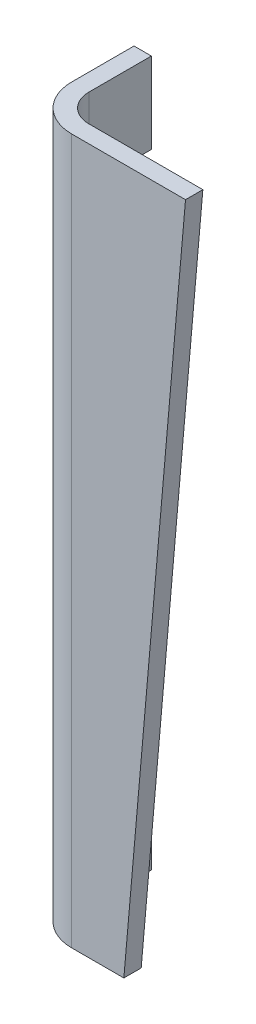
ISO-10303-21;
HEADER;
FILE_DESCRIPTION(('STEP AP214'),'2;1');
FILE_NAME('part.step','',(''),(''),'','','');
FILE_SCHEMA(('AUTOMOTIVE_DESIGN { 1 0 10303 214 1 1 1 1 }'));
ENDSEC;
DATA;
#1=APPLICATION_CONTEXT('core data for automotive mechanical design processes');
#2=APPLICATION_PROTOCOL_DEFINITION('international standard','automotive_design',2000,#1);
#3=PRODUCT_CONTEXT('',#1,'mechanical');
#4=PRODUCT('Part','Part','',(#3));
#5=PRODUCT_RELATED_PRODUCT_CATEGORY('part','',(#4));
#6=PRODUCT_DEFINITION_FORMATION('','',#4);
#7=PRODUCT_DEFINITION_CONTEXT('part definition',#1,'design');
#8=PRODUCT_DEFINITION('design','',#6,#7);
#9=PRODUCT_DEFINITION_SHAPE('','',#8);
#10=(LENGTH_UNIT() NAMED_UNIT(*) SI_UNIT(.MILLI.,.METRE.));
#11=(NAMED_UNIT(*) PLANE_ANGLE_UNIT() SI_UNIT($,.RADIAN.));
#12=(NAMED_UNIT(*) SI_UNIT($,.STERADIAN.) SOLID_ANGLE_UNIT());
#13=UNCERTAINTY_MEASURE_WITH_UNIT(LENGTH_MEASURE(1.E-05),#10,'distance_accuracy_value','');
#14=(GEOMETRIC_REPRESENTATION_CONTEXT(3) GLOBAL_UNCERTAINTY_ASSIGNED_CONTEXT((#13)) GLOBAL_UNIT_ASSIGNED_CONTEXT((#10,
#11,#12)) REPRESENTATION_CONTEXT('',''));
#15=CARTESIAN_POINT('',(0.,0.,0.));
#16=DIRECTION('',(0.,0.,1.));
#17=DIRECTION('',(1.,0.,0.));
#18=AXIS2_PLACEMENT_3D('',#15,#16,#17);
#19=CARTESIAN_POINT('',(40.07981211837,63.84236,-113.94034));
#20=DIRECTION('',(-1.,0.,0.));
#21=DIRECTION('',(0.,0.,1.));
#22=AXIS2_PLACEMENT_3D('',#19,#20,#21);
#23=CYLINDRICAL_SURFACE('',#22,2.381);
#24=CARTESIAN_POINT('',(32.73633124671,63.84236,-113.94034));
#25=DIRECTION('',(-1.,0.,0.));
#26=DIRECTION('',(0.,0.,1.));
#27=AXIS2_PLACEMENT_3D('',#24,#25,#26);
#28=CIRCLE('',#27,2.381);
#29=CARTESIAN_POINT('',(32.73633124671,66.22336,-113.94034));
#30=VERTEX_POINT('',#29);
#31=CARTESIAN_POINT('',(32.73633124671,63.84236,-111.55934));
#32=VERTEX_POINT('',#31);
#33=EDGE_CURVE('E167',#30,#32,#28,.F.);
#34=ORIENTED_EDGE('',*,*,#33,.T.);
#35=DIRECTION('',(1.,0.,0.));
#36=VECTOR('',#35,1.);
#37=CARTESIAN_POINT('',(72.09491389266,63.84236,-111.55934));
#38=LINE('',#37,#36);
#39=CARTESIAN_POINT('',(29.73633124671,63.84236,-111.55934));
#40=VERTEX_POINT('',#39);
#41=EDGE_CURVE('E166',#32,#40,#38,.F.);
#42=ORIENTED_EDGE('',*,*,#41,.T.);
#43=CARTESIAN_POINT('',(29.73633124671,63.84236,-113.94034));
#44=DIRECTION('',(-1.,0.,0.));
#45=DIRECTION('',(0.,0.,1.));
#46=AXIS2_PLACEMENT_3D('',#43,#44,#45);
#47=CIRCLE('',#46,2.381);
#48=CARTESIAN_POINT('',(29.73633124671,66.22336,-113.94034));
#49=VERTEX_POINT('',#48);
#50=EDGE_CURVE('E20',#49,#40,#47,.F.);
#51=ORIENTED_EDGE('',*,*,#50,.F.);
#52=DIRECTION('',(1.,0.,0.));
#53=VECTOR('',#52,1.);
#54=CARTESIAN_POINT('',(40.07981211837,66.22336,-113.94034));
#55=LINE('',#54,#53);
#56=EDGE_CURVE('E151',#49,#30,#55,.T.);
#57=ORIENTED_EDGE('',*,*,#56,.T.);
#58=EDGE_LOOP('',(#34,#42,#51,#57));
#59=FACE_BOUND('',#58,.T.);
#60=ADVANCED_FACE('F17',(#59),#23,.F.);
#61=CARTESIAN_POINT('',(72.09491389266,65.14211,-111.55934));
#62=DIRECTION('',(0.,0.,1.));
#63=DIRECTION('',(1.,0.,0.));
#64=AXIS2_PLACEMENT_3D('',#61,#62,#63);
#65=PLANE('',#64);
#66=DIRECTION('',(0.,1.,0.));
#67=VECTOR('',#66,1.);
#68=CARTESIAN_POINT('',(32.73633124671,0.,-111.55934));
#69=LINE('',#68,#67);
#70=CARTESIAN_POINT('',(32.73633124671,6.40461,-111.55934));
#71=VERTEX_POINT('',#70);
#72=EDGE_CURVE('E278',#32,#71,#69,.F.);
#73=ORIENTED_EDGE('',*,*,#72,.T.);
#74=DIRECTION('',(-1.,0.,0.));
#75=VECTOR('',#74,1.);
#76=CARTESIAN_POINT('',(72.09491389266,6.40461,-111.55934));
#77=LINE('',#76,#75);
#78=CARTESIAN_POINT('',(29.73633124671,6.40461,-111.55934));
#79=VERTEX_POINT('',#78);
#80=EDGE_CURVE('E171',#71,#79,#77,.T.);
#81=ORIENTED_EDGE('',*,*,#80,.T.);
#82=DIRECTION('',(0.,1.,0.));
#83=VECTOR('',#82,1.);
#84=CARTESIAN_POINT('',(29.73633124671,0.,-111.55934));
#85=LINE('',#84,#83);
#86=EDGE_CURVE('E160',#40,#79,#85,.F.);
#87=ORIENTED_EDGE('',*,*,#86,.F.);
#88=ORIENTED_EDGE('',*,*,#41,.F.);
#89=EDGE_LOOP('',(#73,#81,#87,#88));
#90=FACE_BOUND('',#89,.T.);
#91=ADVANCED_FACE('F173',(#90),#65,.F.);
#92=CARTESIAN_POINT('',(72.09491389266,6.40461,-113.94059));
#93=DIRECTION('',(-1.,0.,0.));
#94=DIRECTION('',(0.,0.,1.));
#95=AXIS2_PLACEMENT_3D('',#92,#93,#94);
#96=CYLINDRICAL_SURFACE('',#95,2.38125);
#97=CARTESIAN_POINT('',(32.73633124671,6.40461,-113.94059));
#98=DIRECTION('',(-1.,0.,0.));
#99=DIRECTION('',(0.,0.,1.));
#100=AXIS2_PLACEMENT_3D('',#97,#98,#99);
#101=CIRCLE('',#100,2.38125);
#102=CARTESIAN_POINT('',(32.73633124671,4.02336,-113.94059));
#103=VERTEX_POINT('',#102);
#104=EDGE_CURVE('E275',#71,#103,#101,.F.);
#105=ORIENTED_EDGE('',*,*,#104,.T.);
#106=DIRECTION('',(1.,0.,0.));
#107=VECTOR('',#106,1.);
#108=CARTESIAN_POINT('',(72.09491389266,4.02336,-113.94059));
#109=LINE('',#108,#107);
#110=CARTESIAN_POINT('',(29.73633124671,4.02336,-113.94059));
#111=VERTEX_POINT('',#110);
#112=EDGE_CURVE('E241',#103,#111,#109,.F.);
#113=ORIENTED_EDGE('',*,*,#112,.T.);
#114=CARTESIAN_POINT('',(29.73633124671,6.40461,-113.94059));
#115=DIRECTION('',(-1.,0.,0.));
#116=DIRECTION('',(0.,0.,1.));
#117=AXIS2_PLACEMENT_3D('',#114,#115,#116);
#118=CIRCLE('',#117,2.38125);
#119=EDGE_CURVE('E175',#79,#111,#118,.F.);
#120=ORIENTED_EDGE('',*,*,#119,.F.);
#121=ORIENTED_EDGE('',*,*,#80,.F.);
#122=EDGE_LOOP('',(#105,#113,#120,#121));
#123=FACE_BOUND('',#122,.T.);
#124=ADVANCED_FACE('F437',(#123),#96,.F.);
#125=CARTESIAN_POINT('',(72.09491389266,4.02336,-113.94059));
#126=DIRECTION('',(0.,-1.,0.));
#127=DIRECTION('',(0.,0.,-1.));
#128=AXIS2_PLACEMENT_3D('',#125,#126,#127);
#129=PLANE('',#128);
#130=DIRECTION('',(0.,0.,1.));
#131=VECTOR('',#130,1.);
#132=CARTESIAN_POINT('',(32.73633124671,4.02336,-2.75336));
#133=LINE('',#132,#131);
#134=CARTESIAN_POINT('',(32.73633124671,4.02336,-116.32184));
#135=VERTEX_POINT('',#134);
#136=EDGE_CURVE('E237',#103,#135,#133,.F.);
#137=ORIENTED_EDGE('',*,*,#136,.T.);
#138=DIRECTION('',(-1.,0.,0.));
#139=VECTOR('',#138,1.);
#140=CARTESIAN_POINT('',(27.97383124671,4.02336,-116.32184));
#141=LINE('',#140,#139);
#142=CARTESIAN_POINT('',(29.73633124671,4.02336,-116.32184));
#143=VERTEX_POINT('',#142);
#144=EDGE_CURVE('E230',#143,#135,#141,.F.);
#145=ORIENTED_EDGE('',*,*,#144,.F.);
#146=DIRECTION('',(0.,0.,1.));
#147=VECTOR('',#146,1.);
#148=CARTESIAN_POINT('',(29.73633124671,4.02336,-2.75336));
#149=LINE('',#148,#147);
#150=EDGE_CURVE('E177',#111,#143,#149,.F.);
#151=ORIENTED_EDGE('',*,*,#150,.F.);
#152=ORIENTED_EDGE('',*,*,#112,.F.);
#153=EDGE_LOOP('',(#137,#145,#151,#152));
#154=FACE_BOUND('',#153,.T.);
#155=ADVANCED_FACE('F296',(#154),#129,.F.);
#156=CARTESIAN_POINT('',(27.97383124671,80.22336,-116.32184));
#157=DIRECTION('',(0.,0.,-1.));
#158=DIRECTION('',(-1.,0.,0.));
#159=AXIS2_PLACEMENT_3D('',#156,#157,#158);
#160=PLANE('',#159);
#161=DIRECTION('',(0.,1.,0.));
#162=VECTOR('',#161,1.);
#163=CARTESIAN_POINT('',(32.73633124671,0.,-116.32184));
#164=LINE('',#163,#162);
#165=CARTESIAN_POINT('',(32.73633124671,-13.75664,-116.32184));
#166=VERTEX_POINT('',#165);
#167=EDGE_CURVE('E233',#135,#166,#164,.F.);
#168=ORIENTED_EDGE('',*,*,#167,.T.);
#169=DIRECTION('',(1.,0.,0.));
#170=VECTOR('',#169,1.);
#171=CARTESIAN_POINT('',(-25.79021716039,-13.75664,-116.32184));
#172=LINE('',#171,#170);
#173=CARTESIAN_POINT('',(29.73633124671,-13.75664,-116.32184));
#174=VERTEX_POINT('',#173);
#175=EDGE_CURVE('E227',#166,#174,#172,.F.);
#176=ORIENTED_EDGE('',*,*,#175,.T.);
#177=DIRECTION('',(0.,1.,0.));
#178=VECTOR('',#177,1.);
#179=CARTESIAN_POINT('',(29.73633124671,0.,-116.32184));
#180=LINE('',#179,#178);
#181=EDGE_CURVE('E247',#143,#174,#180,.F.);
#182=ORIENTED_EDGE('',*,*,#181,.F.);
#183=ORIENTED_EDGE('',*,*,#144,.T.);
#184=EDGE_LOOP('',(#168,#176,#182,#183));
#185=FACE_BOUND('',#184,.T.);
#186=ADVANCED_FACE('F300',(#185),#160,.T.);
#187=CARTESIAN_POINT('',(-25.79021716039,-13.75664,-116.32184));
#188=DIRECTION('',(0.,1.,0.));
#189=DIRECTION('',(0.,0.,1.));
#190=AXIS2_PLACEMENT_3D('',#187,#188,#189);
#191=PLANE('',#190);
#192=DIRECTION('',(0.,0.,1.));
#193=VECTOR('',#192,1.);
#194=CARTESIAN_POINT('',(32.73633124671,-13.75664,-2.75336));
#195=LINE('',#194,#193);
#196=CARTESIAN_POINT('',(32.73633124671,-13.75664,-113.94059));
#197=VERTEX_POINT('',#196);
#198=EDGE_CURVE('E236',#166,#197,#195,.T.);
#199=ORIENTED_EDGE('',*,*,#198,.T.);
#200=DIRECTION('',(1.,0.,0.));
#201=VECTOR('',#200,1.);
#202=CARTESIAN_POINT('',(-25.79021716039,-13.75664,-113.94059));
#203=LINE('',#202,#201);
#204=CARTESIAN_POINT('',(29.73633124671,-13.75664,-113.94059));
#205=VERTEX_POINT('',#204);
#206=EDGE_CURVE('E224',#197,#205,#203,.F.);
#207=ORIENTED_EDGE('',*,*,#206,.T.);
#208=DIRECTION('',(0.,0.,1.));
#209=VECTOR('',#208,1.);
#210=CARTESIAN_POINT('',(29.73633124671,-13.75664,-2.75336));
#211=LINE('',#210,#209);
#212=EDGE_CURVE('E249',#174,#205,#211,.T.);
#213=ORIENTED_EDGE('',*,*,#212,.F.);
#214=ORIENTED_EDGE('',*,*,#175,.F.);
#215=EDGE_LOOP('',(#199,#207,#213,#214));
#216=FACE_BOUND('',#215,.T.);
#217=ADVANCED_FACE('F304',(#216),#191,.F.);
#218=CARTESIAN_POINT('',(-25.79021716039,-16.13789,-113.94059));
#219=DIRECTION('',(1.,0.,0.));
#220=DIRECTION('',(0.,0.,-1.));
#221=AXIS2_PLACEMENT_3D('',#218,#219,#220);
#222=CYLINDRICAL_SURFACE('',#221,2.38125);
#223=CARTESIAN_POINT('',(32.73633124671,-16.13789,-113.94059));
#224=DIRECTION('',(1.,0.,0.));
#225=DIRECTION('',(0.,0.,-1.));
#226=AXIS2_PLACEMENT_3D('',#223,#224,#225);
#227=CIRCLE('',#226,2.38125);
#228=CARTESIAN_POINT('',(32.73633124671,-16.13789,-111.55934));
#229=VERTEX_POINT('',#228);
#230=EDGE_CURVE('E272',#197,#229,#227,.T.);
#231=ORIENTED_EDGE('',*,*,#230,.T.);
#232=DIRECTION('',(1.,0.,0.));
#233=VECTOR('',#232,1.);
#234=CARTESIAN_POINT('',(-25.79021716039,-16.13789,-111.55934));
#235=LINE('',#234,#233);
#236=CARTESIAN_POINT('',(29.73633124671,-16.13789,-111.55934));
#237=VERTEX_POINT('',#236);
#238=EDGE_CURVE('E221',#229,#237,#235,.F.);
#239=ORIENTED_EDGE('',*,*,#238,.T.);
#240=CARTESIAN_POINT('',(29.73633124671,-16.13789,-113.94059));
#241=DIRECTION('',(1.,0.,0.));
#242=DIRECTION('',(0.,0.,-1.));
#243=AXIS2_PLACEMENT_3D('',#240,#241,#242);
#244=CIRCLE('',#243,2.38125);
#245=EDGE_CURVE('E283',#205,#237,#244,.T.);
#246=ORIENTED_EDGE('',*,*,#245,.F.);
#247=ORIENTED_EDGE('',*,*,#206,.F.);
#248=EDGE_LOOP('',(#231,#239,#246,#247));
#249=FACE_BOUND('',#248,.T.);
#250=ADVANCED_FACE('F307',(#249),#222,.F.);
#251=CARTESIAN_POINT('',(-25.79021716039,-16.13789,-111.55934));
#252=DIRECTION('',(0.,0.,1.));
#253=DIRECTION('',(1.,0.,0.));
#254=AXIS2_PLACEMENT_3D('',#251,#252,#253);
#255=PLANE('',#254);
#256=DIRECTION('',(0.,1.,0.));
#257=VECTOR('',#256,1.);
#258=CARTESIAN_POINT('',(32.73633124671,0.,-111.55934));
#259=LINE('',#258,#257);
#260=CARTESIAN_POINT('',(32.73633124671,-26.29789,-111.55934));
#261=VERTEX_POINT('',#260);
#262=EDGE_CURVE('E271',#229,#261,#259,.F.);
#263=ORIENTED_EDGE('',*,*,#262,.T.);
#264=DIRECTION('',(1.,0.,0.));
#265=VECTOR('',#264,1.);
#266=CARTESIAN_POINT('',(-25.79021716039,-26.29789,-111.55934));
#267=LINE('',#266,#265);
#268=CARTESIAN_POINT('',(29.73633124671,-26.29789,-111.55934));
#269=VERTEX_POINT('',#268);
#270=EDGE_CURVE('E218',#261,#269,#267,.F.);
#271=ORIENTED_EDGE('',*,*,#270,.T.);
#272=DIRECTION('',(0.,1.,0.));
#273=VECTOR('',#272,1.);
#274=CARTESIAN_POINT('',(29.73633124671,0.,-111.55934));
#275=LINE('',#274,#273);
#276=EDGE_CURVE('E282',#237,#269,#275,.F.);
#277=ORIENTED_EDGE('',*,*,#276,.F.);
#278=ORIENTED_EDGE('',*,*,#238,.F.);
#279=EDGE_LOOP('',(#263,#271,#277,#278));
#280=FACE_BOUND('',#279,.T.);
#281=ADVANCED_FACE('F312',(#280),#255,.F.);
#282=CARTESIAN_POINT('',(-25.79021716039,-26.29789,-113.94059));
#283=DIRECTION('',(1.,0.,0.));
#284=DIRECTION('',(0.,0.,-1.));
#285=AXIS2_PLACEMENT_3D('',#282,#283,#284);
#286=CYLINDRICAL_SURFACE('',#285,2.38125);
#287=CARTESIAN_POINT('',(32.73633124671,-26.29789,-113.94059));
#288=DIRECTION('',(1.,0.,0.));
#289=DIRECTION('',(0.,0.,-1.));
#290=AXIS2_PLACEMENT_3D('',#287,#288,#289);
#291=CIRCLE('',#290,2.38125);
#292=CARTESIAN_POINT('',(32.73633124671,-28.67914,-113.94059));
#293=VERTEX_POINT('',#292);
#294=EDGE_CURVE('E267',#261,#293,#291,.T.);
#295=ORIENTED_EDGE('',*,*,#294,.T.);
#296=DIRECTION('',(1.,0.,0.));
#297=VECTOR('',#296,1.);
#298=CARTESIAN_POINT('',(-25.79021716039,-28.67914,-113.94059));
#299=LINE('',#298,#297);
#300=CARTESIAN_POINT('',(29.73633124671,-28.67914,-113.94059));
#301=VERTEX_POINT('',#300);
#302=EDGE_CURVE('E207',#293,#301,#299,.F.);
#303=ORIENTED_EDGE('',*,*,#302,.T.);
#304=CARTESIAN_POINT('',(29.73633124671,-26.29789,-113.94059));
#305=DIRECTION('',(1.,0.,0.));
#306=DIRECTION('',(0.,0.,-1.));
#307=AXIS2_PLACEMENT_3D('',#304,#305,#306);
#308=CIRCLE('',#307,2.38125);
#309=EDGE_CURVE('E280',#269,#301,#308,.T.);
#310=ORIENTED_EDGE('',*,*,#309,.F.);
#311=ORIENTED_EDGE('',*,*,#270,.F.);
#312=EDGE_LOOP('',(#295,#303,#310,#311));
#313=FACE_BOUND('',#312,.T.);
#314=ADVANCED_FACE('F318',(#313),#286,.F.);
#315=CARTESIAN_POINT('',(-25.79021716039,-28.67914,-116.32184));
#316=DIRECTION('',(0.,-1.,0.));
#317=DIRECTION('',(0.,0.,-1.));
#318=AXIS2_PLACEMENT_3D('',#315,#316,#317);
#319=PLANE('',#318);
#320=DIRECTION('',(0.,0.,1.));
#321=VECTOR('',#320,1.);
#322=CARTESIAN_POINT('',(32.73633124671,-28.67914,-2.75336));
#323=LINE('',#322,#321);
#324=CARTESIAN_POINT('',(32.73633124671,-28.67914,-116.32184));
#325=VERTEX_POINT('',#324);
#326=EDGE_CURVE('E270',#293,#325,#323,.F.);
#327=ORIENTED_EDGE('',*,*,#326,.T.);
#328=DIRECTION('',(-1.,0.,0.));
#329=VECTOR('',#328,1.);
#330=CARTESIAN_POINT('',(27.97383124671,-28.67914,-116.32184));
#331=LINE('',#330,#329);
#332=CARTESIAN_POINT('',(29.73633124671,-28.67914,-116.32184));
#333=VERTEX_POINT('',#332);
#334=EDGE_CURVE('E211',#333,#325,#331,.F.);
#335=ORIENTED_EDGE('',*,*,#334,.F.);
#336=DIRECTION('',(0.,0.,1.));
#337=VECTOR('',#336,1.);
#338=CARTESIAN_POINT('',(29.73633124671,-28.67914,-2.75336));
#339=LINE('',#338,#337);
#340=EDGE_CURVE('E185',#301,#333,#339,.F.);
#341=ORIENTED_EDGE('',*,*,#340,.F.);
#342=ORIENTED_EDGE('',*,*,#302,.F.);
#343=EDGE_LOOP('',(#327,#335,#341,#342));
#344=FACE_BOUND('',#343,.T.);
#345=ADVANCED_FACE('F324',(#344),#319,.F.);
#346=CARTESIAN_POINT('',(40.07981211837,66.22336,-116.32184));
#347=DIRECTION('',(0.,1.,0.));
#348=DIRECTION('',(0.,0.,1.));
#349=AXIS2_PLACEMENT_3D('',#346,#347,#348);
#350=PLANE('',#349);
#351=DIRECTION('',(0.,0.,1.));
#352=VECTOR('',#351,1.);
#353=CARTESIAN_POINT('',(32.73633124671,66.22336,-2.75336));
#354=LINE('',#353,#352);
#355=CARTESIAN_POINT('',(32.73633124671,66.22336,-116.32184));
#356=VERTEX_POINT('',#355);
#357=EDGE_CURVE('E189',#356,#30,#354,.T.);
#358=ORIENTED_EDGE('',*,*,#357,.T.);
#359=ORIENTED_EDGE('',*,*,#56,.F.);
#360=DIRECTION('',(0.,0.,1.));
#361=VECTOR('',#360,1.);
#362=CARTESIAN_POINT('',(29.73633124671,66.22336,-2.75336));
#363=LINE('',#362,#361);
#364=CARTESIAN_POINT('',(29.73633124671,66.22336,-116.32184));
#365=VERTEX_POINT('',#364);
#366=EDGE_CURVE('E162',#365,#49,#363,.T.);
#367=ORIENTED_EDGE('',*,*,#366,.F.);
#368=DIRECTION('',(-1.,0.,0.));
#369=VECTOR('',#368,1.);
#370=CARTESIAN_POINT('',(27.97383124671,66.22336,-116.32184));
#371=LINE('',#370,#369);
#372=EDGE_CURVE('E164',#356,#365,#371,.T.);
#373=ORIENTED_EDGE('',*,*,#372,.F.);
#374=EDGE_LOOP('',(#358,#359,#367,#373));
#375=FACE_BOUND('',#374,.T.);
#376=ADVANCED_FACE('F473',(#375),#350,.F.);
#377=CARTESIAN_POINT('',(27.97383124671,80.22336,-116.32184));
#378=DIRECTION('',(0.,0.,-1.));
#379=DIRECTION('',(-1.,0.,0.));
#380=AXIS2_PLACEMENT_3D('',#377,#378,#379);
#381=PLANE('',#380);
#382=DIRECTION('',(0.,1.,0.));
#383=VECTOR('',#382,1.);
#384=CARTESIAN_POINT('',(32.73633124671,0.,-116.32184));
#385=LINE('',#384,#383);
#386=CARTESIAN_POINT('',(32.73633124671,80.22336,-116.32184));
#387=VERTEX_POINT('',#386);
#388=EDGE_CURVE('E190',#387,#356,#385,.F.);
#389=ORIENTED_EDGE('',*,*,#388,.T.);
#390=ORIENTED_EDGE('',*,*,#372,.T.);
#391=DIRECTION('',(0.,1.,0.));
#392=VECTOR('',#391,1.);
#393=CARTESIAN_POINT('',(29.73633124671,0.,-116.32184));
#394=LINE('',#393,#392);
#395=CARTESIAN_POINT('',(29.73633124671,80.22336,-116.32184));
#396=VERTEX_POINT('',#395);
#397=EDGE_CURVE('E184',#396,#365,#394,.F.);
#398=ORIENTED_EDGE('',*,*,#397,.F.);
#399=DIRECTION('',(1.,0.,0.));
#400=VECTOR('',#399,1.);
#401=CARTESIAN_POINT('',(37.51153124671,80.22336,-116.32184));
#402=LINE('',#401,#400);
#403=EDGE_CURVE('E196',#396,#387,#402,.T.);
#404=ORIENTED_EDGE('',*,*,#403,.T.);
#405=EDGE_LOOP('',(#389,#390,#398,#404));
#406=FACE_BOUND('',#405,.T.);
#407=ADVANCED_FACE('F470',(#406),#381,.T.);
#408=CARTESIAN_POINT('',(37.51153124671,80.22336,-105.53192));
#409=DIRECTION('',(0.,1.,0.));
#410=DIRECTION('',(0.,0.,1.));
#411=AXIS2_PLACEMENT_3D('',#408,#409,#410);
#412=CYLINDRICAL_SURFACE('',#411,7.7752);
#413=CARTESIAN_POINT('',(37.51153124671,-41.69664,-105.53192));
#414=DIRECTION('',(0.,1.,0.));
#415=DIRECTION('',(0.,0.,1.));
#416=AXIS2_PLACEMENT_3D('',#413,#414,#415);
#417=CIRCLE('',#416,7.7752);
#418=CARTESIAN_POINT('',(37.51153124671,-41.69664,-97.75672));
#419=VERTEX_POINT('',#418);
#420=CARTESIAN_POINT('',(29.73633124671,-41.69664,-105.53192));
#421=VERTEX_POINT('',#420);
#422=EDGE_CURVE('E256',#419,#421,#417,.F.);
#423=ORIENTED_EDGE('',*,*,#422,.F.);
#424=DIRECTION('',(0.,1.,0.));
#425=VECTOR('',#424,1.);
#426=CARTESIAN_POINT('',(37.51153124671,1.796885685326E-13,-97.75672));
#427=LINE('',#426,#425);
#428=CARTESIAN_POINT('',(37.51153124671,80.22336,-97.75672));
#429=VERTEX_POINT('',#428);
#430=EDGE_CURVE('E186',#429,#419,#427,.F.);
#431=ORIENTED_EDGE('',*,*,#430,.F.);
#432=CARTESIAN_POINT('',(37.51153124671,80.22336,-105.53192));
#433=DIRECTION('',(0.,1.,0.));
#434=DIRECTION('',(0.,0.,1.));
#435=AXIS2_PLACEMENT_3D('',#432,#433,#434);
#436=CIRCLE('',#435,7.7752);
#437=CARTESIAN_POINT('',(29.73633124671,80.22336,-105.53192));
#438=VERTEX_POINT('',#437);
#439=EDGE_CURVE('E188',#429,#438,#436,.F.);
#440=ORIENTED_EDGE('',*,*,#439,.T.);
#441=DIRECTION('',(0.,1.,0.));
#442=VECTOR('',#441,1.);
#443=CARTESIAN_POINT('',(29.73633124671,0.,-105.53192));
#444=LINE('',#443,#442);
#445=EDGE_CURVE('E182',#421,#438,#444,.T.);
#446=ORIENTED_EDGE('',*,*,#445,.F.);
#447=EDGE_LOOP('',(#423,#431,#440,#446));
#448=FACE_BOUND('',#447,.T.);
#449=ADVANCED_FACE('F430',(#448),#412,.T.);
#450=CARTESIAN_POINT('',(29.73633124671,0.,-2.75336));
#451=DIRECTION('',(-1.,0.,0.));
#452=DIRECTION('',(0.,0.,1.));
#453=AXIS2_PLACEMENT_3D('',#450,#451,#452);
#454=PLANE('',#453);
#455=ORIENTED_EDGE('',*,*,#397,.T.);
#456=ORIENTED_EDGE('',*,*,#366,.T.);
#457=ORIENTED_EDGE('',*,*,#50,.T.);
#458=ORIENTED_EDGE('',*,*,#86,.T.);
#459=ORIENTED_EDGE('',*,*,#119,.T.);
#460=ORIENTED_EDGE('',*,*,#150,.T.);
#461=ORIENTED_EDGE('',*,*,#181,.T.);
#462=ORIENTED_EDGE('',*,*,#212,.T.);
#463=ORIENTED_EDGE('',*,*,#245,.T.);
#464=ORIENTED_EDGE('',*,*,#276,.T.);
#465=ORIENTED_EDGE('',*,*,#309,.T.);
#466=ORIENTED_EDGE('',*,*,#340,.T.);
#467=DIRECTION('',(0.,1.,0.));
#468=VECTOR('',#467,1.);
#469=CARTESIAN_POINT('',(29.73633124671,80.22336,-116.32184));
#470=LINE('',#469,#468);
#471=CARTESIAN_POINT('',(29.73633124671,-41.69664,-116.32184));
#472=VERTEX_POINT('',#471);
#473=EDGE_CURVE('E213',#472,#333,#470,.T.);
#474=ORIENTED_EDGE('',*,*,#473,.F.);
#475=DIRECTION('',(0.,0.,-1.));
#476=VECTOR('',#475,1.);
#477=CARTESIAN_POINT('',(29.73633124671,-41.69664,-105.53192));
#478=LINE('',#477,#476);
#479=EDGE_CURVE('E258',#421,#472,#478,.T.);
#480=ORIENTED_EDGE('',*,*,#479,.F.);
#481=ORIENTED_EDGE('',*,*,#445,.T.);
#482=DIRECTION('',(0.,0.,-1.));
#483=VECTOR('',#482,1.);
#484=CARTESIAN_POINT('',(29.73633124671,80.22336,-105.53192));
#485=LINE('',#484,#483);
#486=EDGE_CURVE('E200',#438,#396,#485,.T.);
#487=ORIENTED_EDGE('',*,*,#486,.T.);
#488=EDGE_LOOP('',(#455,#456,#457,#458,#459,#460,#461,#462,#463,#464,#465,#466,#474,#480,#481,#487));
#489=FACE_BOUND('',#488,.T.);
#490=ADVANCED_FACE('F158',(#489),#454,.T.);
#491=CARTESIAN_POINT('',(27.97383124671,80.22336,-116.32184));
#492=DIRECTION('',(0.,0.,-1.));
#493=DIRECTION('',(-1.,0.,0.));
#494=AXIS2_PLACEMENT_3D('',#491,#492,#493);
#495=PLANE('',#494);
#496=ORIENTED_EDGE('',*,*,#473,.T.);
#497=ORIENTED_EDGE('',*,*,#334,.T.);
#498=DIRECTION('',(0.,1.,0.));
#499=VECTOR('',#498,1.);
#500=CARTESIAN_POINT('',(32.73633124671,0.,-116.32184));
#501=LINE('',#500,#499);
#502=CARTESIAN_POINT('',(32.73633124671,-41.69664,-116.32184));
#503=VERTEX_POINT('',#502);
#504=EDGE_CURVE('E193',#325,#503,#501,.F.);
#505=ORIENTED_EDGE('',*,*,#504,.T.);
#506=DIRECTION('',(1.,0.,0.));
#507=VECTOR('',#506,1.);
#508=CARTESIAN_POINT('',(37.51153124671,-41.69664,-116.32184));
#509=LINE('',#508,#507);
#510=EDGE_CURVE('E336',#472,#503,#509,.T.);
#511=ORIENTED_EDGE('',*,*,#510,.F.);
#512=EDGE_LOOP('',(#496,#497,#505,#511));
#513=FACE_BOUND('',#512,.T.);
#514=ADVANCED_FACE('F434',(#513),#495,.T.);
#515=CARTESIAN_POINT('',(32.73633124671,0.,-2.75336));
#516=DIRECTION('',(-1.,0.,0.));
#517=DIRECTION('',(0.,0.,1.));
#518=AXIS2_PLACEMENT_3D('',#515,#516,#517);
#519=PLANE('',#518);
#520=ORIENTED_EDGE('',*,*,#388,.F.);
#521=DIRECTION('',(0.,0.,-1.));
#522=VECTOR('',#521,1.);
#523=CARTESIAN_POINT('',(32.73633124671,80.22336,-105.53192));
#524=LINE('',#523,#522);
#525=CARTESIAN_POINT('',(32.73633124671,80.22336,-105.53192));
#526=VERTEX_POINT('',#525);
#527=EDGE_CURVE('E199',#387,#526,#524,.F.);
#528=ORIENTED_EDGE('',*,*,#527,.T.);
#529=DIRECTION('',(0.,1.,0.));
#530=VECTOR('',#529,1.);
#531=CARTESIAN_POINT('',(32.73633124671,80.22336,-105.53192));
#532=LINE('',#531,#530);
#533=CARTESIAN_POINT('',(32.73633124671,-41.69664,-105.53192));
#534=VERTEX_POINT('',#533);
#535=EDGE_CURVE('E263',#526,#534,#532,.F.);
#536=ORIENTED_EDGE('',*,*,#535,.T.);
#537=DIRECTION('',(0.,0.,-1.));
#538=VECTOR('',#537,1.);
#539=CARTESIAN_POINT('',(32.73633124671,-41.69664,-105.53192));
#540=LINE('',#539,#538);
#541=EDGE_CURVE('E255',#503,#534,#540,.F.);
#542=ORIENTED_EDGE('',*,*,#541,.F.);
#543=ORIENTED_EDGE('',*,*,#504,.F.);
#544=ORIENTED_EDGE('',*,*,#326,.F.);
#545=ORIENTED_EDGE('',*,*,#294,.F.);
#546=ORIENTED_EDGE('',*,*,#262,.F.);
#547=ORIENTED_EDGE('',*,*,#230,.F.);
#548=ORIENTED_EDGE('',*,*,#198,.F.);
#549=ORIENTED_EDGE('',*,*,#167,.F.);
#550=ORIENTED_EDGE('',*,*,#136,.F.);
#551=ORIENTED_EDGE('',*,*,#104,.F.);
#552=ORIENTED_EDGE('',*,*,#72,.F.);
#553=ORIENTED_EDGE('',*,*,#33,.F.);
#554=ORIENTED_EDGE('',*,*,#357,.F.);
#555=EDGE_LOOP('',(#520,#528,#536,#542,#543,#544,#545,#546,#547,#548,#549,#550,#551,#552,#553,#554));
#556=FACE_BOUND('',#555,.T.);
#557=ADVANCED_FACE('F413',(#556),#519,.F.);
#558=CARTESIAN_POINT('',(3.607912331293E-13,1.796885685326E-13,-97.75672));
#559=DIRECTION('',(0.,0.,1.));
#560=DIRECTION('',(1.,0.,0.));
#561=AXIS2_PLACEMENT_3D('',#558,#559,#560);
#562=PLANE('',#561);
#563=DIRECTION('',(1.,0.,0.));
#564=VECTOR('',#563,1.);
#565=CARTESIAN_POINT('',(37.51153124671,-41.69664,-97.75672));
#566=LINE('',#565,#564);
#567=CARTESIAN_POINT('',(46.5415483744104,-41.69664,-97.75672));
#568=VERTEX_POINT('',#567);
#569=EDGE_CURVE('E259',#568,#419,#566,.F.);
#570=ORIENTED_EDGE('',*,*,#569,.F.);
#571=DIRECTION('',(-0.0871557427476639,-0.996194698091745,0.));
#572=VECTOR('',#571,1.);
#573=CARTESIAN_POINT('',(56.81249622541,75.70083113585,-97.75672));
#574=LINE('',#573,#572);
#575=CARTESIAN_POINT('',(57.2081662314913,80.2233599999999,-97.75672));
#576=VERTEX_POINT('',#575);
#577=EDGE_CURVE('E254',#568,#576,#574,.F.);
#578=ORIENTED_EDGE('',*,*,#577,.T.);
#579=DIRECTION('',(1.,0.,0.));
#580=VECTOR('',#579,1.);
#581=CARTESIAN_POINT('',(37.51153124671,80.22336,-97.75672));
#582=LINE('',#581,#580);
#583=EDGE_CURVE('E264',#576,#429,#582,.F.);
#584=ORIENTED_EDGE('',*,*,#583,.T.);
#585=ORIENTED_EDGE('',*,*,#430,.T.);
#586=EDGE_LOOP('',(#570,#578,#584,#585));
#587=FACE_BOUND('',#586,.T.);
#588=ADVANCED_FACE('F459',(#587),#562,.T.);
#589=CARTESIAN_POINT('',(37.51153124671,80.22336,-105.53192));
#590=DIRECTION('',(0.,-1.,0.));
#591=DIRECTION('',(0.,0.,-1.));
#592=AXIS2_PLACEMENT_3D('',#589,#590,#591);
#593=PLANE('',#592);
#594=DIRECTION('',(0.,0.,1.));
#595=VECTOR('',#594,1.);
#596=CARTESIAN_POINT('',(57.2081662314919,80.2233599999998,-100.75672));
#597=LINE('',#596,#595);
#598=CARTESIAN_POINT('',(57.208166231491,80.2233599999999,-100.75672));
#599=VERTEX_POINT('',#598);
#600=EDGE_CURVE('E362',#576,#599,#597,.F.);
#601=ORIENTED_EDGE('',*,*,#600,.T.);
#602=DIRECTION('',(1.,0.,0.));
#603=VECTOR('',#602,1.);
#604=CARTESIAN_POINT('',(3.718307451947E-13,80.22336,-100.75672));
#605=LINE('',#604,#603);
#606=CARTESIAN_POINT('',(37.51153124671,80.22336,-100.75672));
#607=VERTEX_POINT('',#606);
#608=EDGE_CURVE('E380',#599,#607,#605,.F.);
#609=ORIENTED_EDGE('',*,*,#608,.T.);
#610=CARTESIAN_POINT('',(37.51153124671,80.22336,-105.53192));
#611=DIRECTION('',(0.,1.,0.));
#612=DIRECTION('',(0.,0.,1.));
#613=AXIS2_PLACEMENT_3D('',#610,#611,#612);
#614=CIRCLE('',#613,4.7752);
#615=EDGE_CURVE('E260',#607,#526,#614,.F.);
#616=ORIENTED_EDGE('',*,*,#615,.T.);
#617=ORIENTED_EDGE('',*,*,#527,.F.);
#618=ORIENTED_EDGE('',*,*,#403,.F.);
#619=ORIENTED_EDGE('',*,*,#486,.F.);
#620=ORIENTED_EDGE('',*,*,#439,.F.);
#621=ORIENTED_EDGE('',*,*,#583,.F.);
#622=EDGE_LOOP('',(#601,#609,#616,#617,#618,#619,#620,#621));
#623=FACE_BOUND('',#622,.T.);
#624=ADVANCED_FACE('F421',(#623),#593,.F.);
#625=CARTESIAN_POINT('',(37.51153124671,80.22336,-105.53192));
#626=DIRECTION('',(0.,1.,0.));
#627=DIRECTION('',(0.,0.,1.));
#628=AXIS2_PLACEMENT_3D('',#625,#626,#627);
#629=CYLINDRICAL_SURFACE('',#628,4.7752);
#630=ORIENTED_EDGE('',*,*,#535,.F.);
#631=ORIENTED_EDGE('',*,*,#615,.F.);
#632=DIRECTION('',(0.,1.,0.));
#633=VECTOR('',#632,1.);
#634=CARTESIAN_POINT('',(37.51153124671,1.855494344538E-13,-100.75672));
#635=LINE('',#634,#633);
#636=CARTESIAN_POINT('',(37.51153124671,-41.69664,-100.75672));
#637=VERTEX_POINT('',#636);
#638=EDGE_CURVE('E383',#607,#637,#635,.F.);
#639=ORIENTED_EDGE('',*,*,#638,.T.);
#640=CARTESIAN_POINT('',(37.51153124671,-41.69664,-105.53192));
#641=DIRECTION('',(0.,1.,0.));
#642=DIRECTION('',(0.,0.,1.));
#643=AXIS2_PLACEMENT_3D('',#640,#641,#642);
#644=CIRCLE('',#643,4.7752);
#645=EDGE_CURVE('E252',#534,#637,#644,.T.);
#646=ORIENTED_EDGE('',*,*,#645,.F.);
#647=EDGE_LOOP('',(#630,#631,#639,#646));
#648=FACE_BOUND('',#647,.T.);
#649=ADVANCED_FACE('F416',(#648),#629,.F.);
#650=CARTESIAN_POINT('',(37.51153124671,-41.69664,-105.53192));
#651=DIRECTION('',(0.,-1.,0.));
#652=DIRECTION('',(0.,0.,-1.));
#653=AXIS2_PLACEMENT_3D('',#650,#651,#652);
#654=PLANE('',#653);
#655=ORIENTED_EDGE('',*,*,#541,.T.);
#656=ORIENTED_EDGE('',*,*,#645,.T.);
#657=DIRECTION('',(1.,0.,0.));
#658=VECTOR('',#657,1.);
#659=CARTESIAN_POINT('',(3.718307451947E-13,-41.69664,-100.75672));
#660=LINE('',#659,#658);
#661=CARTESIAN_POINT('',(46.5415483744103,-41.69664,-100.75672));
#662=VERTEX_POINT('',#661);
#663=EDGE_CURVE('E26',#637,#662,#660,.T.);
#664=ORIENTED_EDGE('',*,*,#663,.T.);
#665=DIRECTION('',(0.,0.,1.));
#666=VECTOR('',#665,1.);
#667=CARTESIAN_POINT('',(46.5415483744106,-41.6966400000001,-100.75672));
#668=LINE('',#667,#666);
#669=EDGE_CURVE('E34',#662,#568,#668,.T.);
#670=ORIENTED_EDGE('',*,*,#669,.T.);
#671=ORIENTED_EDGE('',*,*,#569,.T.);
#672=ORIENTED_EDGE('',*,*,#422,.T.);
#673=ORIENTED_EDGE('',*,*,#479,.T.);
#674=ORIENTED_EDGE('',*,*,#510,.T.);
#675=EDGE_LOOP('',(#655,#656,#664,#670,#671,#672,#673,#674));
#676=FACE_BOUND('',#675,.T.);
#677=ADVANCED_FACE('F406',(#676),#654,.T.);
#678=CARTESIAN_POINT('',(56.81249622541,75.70083113585,-100.75672));
#679=DIRECTION('',(-0.996194698091745,0.0871557427476639,0.));
#680=DIRECTION('',(-0.0871557427476639,-0.996194698091745,0.));
#681=AXIS2_PLACEMENT_3D('',#678,#679,#680);
#682=PLANE('',#681);
#683=DIRECTION('',(0.0871557427476529,0.996194698091746,0.));
#684=VECTOR('',#683,1.);
#685=CARTESIAN_POINT('',(46.54154837441,-41.69664,-100.75672));
#686=LINE('',#685,#684);
#687=EDGE_CURVE('E11',#662,#599,#686,.T.);
#688=ORIENTED_EDGE('',*,*,#687,.T.);
#689=ORIENTED_EDGE('',*,*,#600,.F.);
#690=ORIENTED_EDGE('',*,*,#577,.F.);
#691=ORIENTED_EDGE('',*,*,#669,.F.);
#692=EDGE_LOOP('',(#688,#689,#690,#691));
#693=FACE_BOUND('',#692,.T.);
#694=ADVANCED_FACE('F423',(#693),#682,.F.);
#695=CARTESIAN_POINT('',(3.718307451947E-13,1.855494344538E-13,-100.75672));
#696=DIRECTION('',(0.,0.,1.));
#697=DIRECTION('',(1.,0.,0.));
#698=AXIS2_PLACEMENT_3D('',#695,#696,#697);
#699=PLANE('',#698);
#700=ORIENTED_EDGE('',*,*,#663,.F.);
#701=ORIENTED_EDGE('',*,*,#638,.F.);
#702=ORIENTED_EDGE('',*,*,#608,.F.);
#703=ORIENTED_EDGE('',*,*,#687,.F.);
#704=EDGE_LOOP('',(#700,#701,#702,#703));
#705=FACE_BOUND('',#704,.T.);
#706=ADVANCED_FACE('F419',(#705),#699,.F.);
#707=CLOSED_SHELL('',(#60,#91,#124,#155,#186,#217,#250,#281,#314,#345,#376,#407,#449,#490,#514,
#557,#588,#624,#649,#677,#694,#706));
#708=MANIFOLD_SOLID_BREP('B1',#707);
#709=ADVANCED_BREP_SHAPE_REPRESENTATION('',(#18,#708),#14);
#710=SHAPE_DEFINITION_REPRESENTATION(#9,#709);
ENDSEC;
END-ISO-10303-21;
